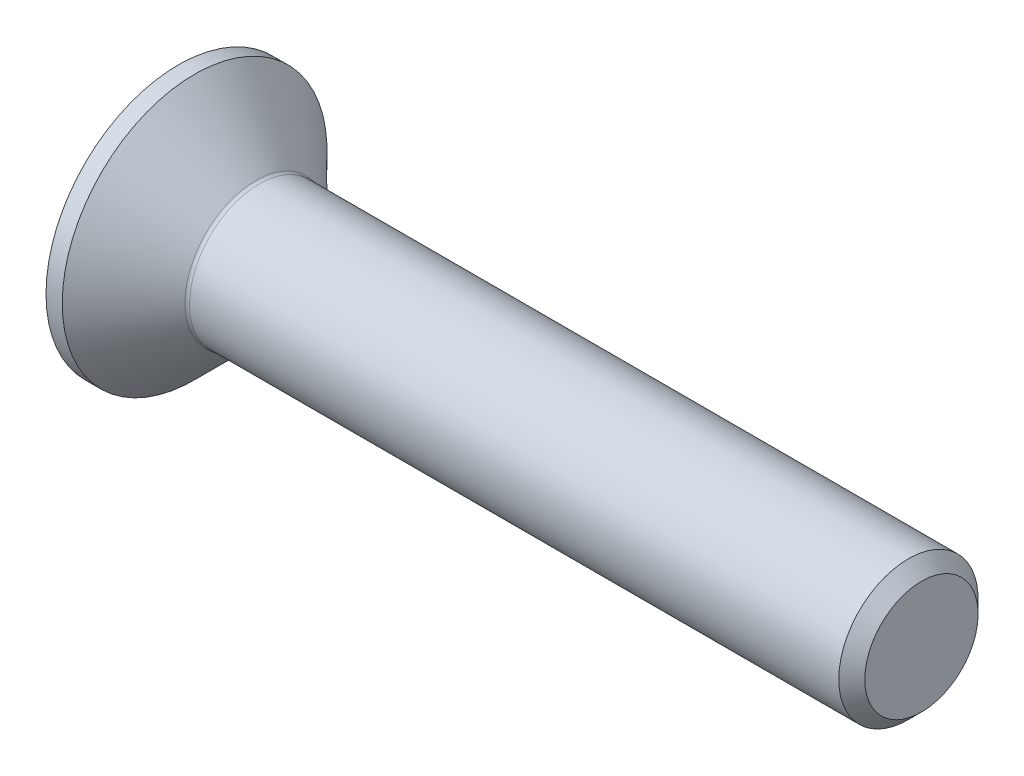
ISO-10303-21;
HEADER;
FILE_DESCRIPTION(('STEP AP214'),'2;1');
FILE_NAME('part.step','',(''),(''),'','','');
FILE_SCHEMA(('AUTOMOTIVE_DESIGN { 1 0 10303 214 1 1 1 1 }'));
ENDSEC;
DATA;
#1=APPLICATION_CONTEXT('core data for automotive mechanical design processes');
#2=APPLICATION_PROTOCOL_DEFINITION('international standard','automotive_design',2000,#1);
#3=PRODUCT_CONTEXT('',#1,'mechanical');
#4=PRODUCT('Part','Part','',(#3));
#5=PRODUCT_RELATED_PRODUCT_CATEGORY('part','',(#4));
#6=PRODUCT_DEFINITION_FORMATION('','',#4);
#7=PRODUCT_DEFINITION_CONTEXT('part definition',#1,'design');
#8=PRODUCT_DEFINITION('design','',#6,#7);
#9=PRODUCT_DEFINITION_SHAPE('','',#8);
#10=(LENGTH_UNIT() NAMED_UNIT(*) SI_UNIT(.MILLI.,.METRE.));
#11=(NAMED_UNIT(*) PLANE_ANGLE_UNIT() SI_UNIT($,.RADIAN.));
#12=(NAMED_UNIT(*) SI_UNIT($,.STERADIAN.) SOLID_ANGLE_UNIT());
#13=UNCERTAINTY_MEASURE_WITH_UNIT(LENGTH_MEASURE(1.E-05),#10,'distance_accuracy_value','');
#14=(GEOMETRIC_REPRESENTATION_CONTEXT(3) GLOBAL_UNCERTAINTY_ASSIGNED_CONTEXT((#13)) GLOBAL_UNIT_ASSIGNED_CONTEXT((#10,
#11,#12)) REPRESENTATION_CONTEXT('',''));
#15=CARTESIAN_POINT('',(0.,0.,0.));
#16=DIRECTION('',(0.,0.,1.));
#17=DIRECTION('',(1.,0.,0.));
#18=AXIS2_PLACEMENT_3D('',#15,#16,#17);
#19=CARTESIAN_POINT('',(0.,0.,0.));
#20=DIRECTION('',(-1.,0.,0.));
#21=DIRECTION('',(0.,0.,1.));
#22=AXIS2_PLACEMENT_3D('',#19,#20,#21);
#23=PLANE('',#22);
#24=CARTESIAN_POINT('',(0.,0.,0.));
#25=DIRECTION('',(-1.,0.,0.));
#26=DIRECTION('',(0.,0.,1.));
#27=AXIS2_PLACEMENT_3D('',#24,#25,#26);
#28=CIRCLE('',#27,2.85);
#29=CARTESIAN_POINT('',(0.,0.,2.85));
#30=VERTEX_POINT('',#29);
#31=EDGE_CURVE('E155',#30,#30,#28,.T.);
#32=ORIENTED_EDGE('',*,*,#31,.T.);
#33=EDGE_LOOP('',(#32));
#34=FACE_BOUND('',#33,.T.);
#35=DIRECTION('',(0.,-0.5,-0.866025403784439));
#36=VECTOR('',#35,1.);
#37=CARTESIAN_POINT('',(0.,-0.583123771881521,1.01));
#38=LINE('',#37,#36);
#39=CARTESIAN_POINT('',(0.,-0.583123771881521,1.01));
#40=VERTEX_POINT('',#39);
#41=CARTESIAN_POINT('',(0.,-1.16624754376304,0.));
#42=VERTEX_POINT('',#41);
#43=EDGE_CURVE('E121',#40,#42,#38,.T.);
#44=ORIENTED_EDGE('',*,*,#43,.T.);
#45=DIRECTION('',(0.,0.5,-0.866025403784439));
#46=VECTOR('',#45,1.);
#47=CARTESIAN_POINT('',(0.,-1.16624754376304,0.));
#48=LINE('',#47,#46);
#49=CARTESIAN_POINT('',(0.,-0.583123771881521,-1.01));
#50=VERTEX_POINT('',#49);
#51=EDGE_CURVE('E52',#42,#50,#48,.T.);
#52=ORIENTED_EDGE('',*,*,#51,.T.);
#53=DIRECTION('',(0.,1.,0.));
#54=VECTOR('',#53,1.);
#55=CARTESIAN_POINT('',(0.,-0.583123771881521,-1.01));
#56=LINE('',#55,#54);
#57=CARTESIAN_POINT('',(0.,0.583123771881523,-1.01));
#58=VERTEX_POINT('',#57);
#59=EDGE_CURVE('E132',#50,#58,#56,.T.);
#60=ORIENTED_EDGE('',*,*,#59,.T.);
#61=DIRECTION('',(0.,0.5,0.866025403784439));
#62=VECTOR('',#61,1.);
#63=CARTESIAN_POINT('',(0.,0.583123771881523,-1.01));
#64=LINE('',#63,#62);
#65=CARTESIAN_POINT('',(0.,1.16624754376305,0.));
#66=VERTEX_POINT('',#65);
#67=EDGE_CURVE('E256',#58,#66,#64,.T.);
#68=ORIENTED_EDGE('',*,*,#67,.T.);
#69=DIRECTION('',(0.,-0.5,0.866025403784439));
#70=VECTOR('',#69,1.);
#71=CARTESIAN_POINT('',(0.,1.16624754376305,0.));
#72=LINE('',#71,#70);
#73=CARTESIAN_POINT('',(0.,0.583123771881523,1.01));
#74=VERTEX_POINT('',#73);
#75=EDGE_CURVE('E259',#66,#74,#72,.T.);
#76=ORIENTED_EDGE('',*,*,#75,.T.);
#77=DIRECTION('',(0.,-1.,0.));
#78=VECTOR('',#77,1.);
#79=CARTESIAN_POINT('',(0.,0.583123771881523,1.01));
#80=LINE('',#79,#78);
#81=EDGE_CURVE('E262',#74,#40,#80,.T.);
#82=ORIENTED_EDGE('',*,*,#81,.T.);
#83=EDGE_LOOP('',(#44,#52,#60,#68,#76,#82));
#84=FACE_BOUND('',#83,.T.);
#85=ADVANCED_FACE('F37',(#34,#84),#23,.T.);
#86=CARTESIAN_POINT('',(0.,0.,0.));
#87=DIRECTION('',(-1.,0.,0.));
#88=DIRECTION('',(0.,0.,1.));
#89=AXIS2_PLACEMENT_3D('',#86,#87,#88);
#90=CYLINDRICAL_SURFACE('',#89,2.85);
#91=CARTESIAN_POINT('',(0.350000000000005,0.,0.));
#92=DIRECTION('',(-1.,0.,0.));
#93=DIRECTION('',(0.,0.,1.));
#94=AXIS2_PLACEMENT_3D('',#91,#92,#93);
#95=CIRCLE('',#94,2.85);
#96=CARTESIAN_POINT('',(0.350000000000005,0.,2.85));
#97=VERTEX_POINT('',#96);
#98=EDGE_CURVE('E152',#97,#97,#95,.T.);
#99=ORIENTED_EDGE('',*,*,#98,.T.);
#100=EDGE_LOOP('',(#99));
#101=FACE_BOUND('',#100,.T.);
#102=ORIENTED_EDGE('',*,*,#31,.F.);
#103=EDGE_LOOP('',(#102));
#104=FACE_BOUND('',#103,.T.);
#105=ADVANCED_FACE('F176',(#101,#104),#90,.T.);
#106=CARTESIAN_POINT('',(0.350000000000005,0.,0.));
#107=DIRECTION('',(-1.,0.,0.));
#108=DIRECTION('',(0.,0.,1.));
#109=AXIS2_PLACEMENT_3D('',#106,#107,#108);
#110=CONICAL_SURFACE('',#109,2.85,0.78539816339745);
#111=CARTESIAN_POINT('',(1.67071067811867,0.,0.));
#112=DIRECTION('',(-1.,0.,0.));
#113=DIRECTION('',(0.,0.,1.));
#114=AXIS2_PLACEMENT_3D('',#111,#112,#113);
#115=CIRCLE('',#114,1.52928932188133);
#116=CARTESIAN_POINT('',(1.67071067811867,0.,1.52928932188133));
#117=VERTEX_POINT('',#116);
#118=EDGE_CURVE('E45',#117,#117,#115,.T.);
#119=ORIENTED_EDGE('',*,*,#118,.T.);
#120=EDGE_LOOP('',(#119));
#121=FACE_BOUND('',#120,.T.);
#122=ORIENTED_EDGE('',*,*,#98,.F.);
#123=EDGE_LOOP('',(#122));
#124=FACE_BOUND('',#123,.T.);
#125=ADVANCED_FACE('F160',(#121,#124),#110,.T.);
#126=CARTESIAN_POINT('',(0.,0.,0.));
#127=DIRECTION('',(-1.,0.,0.));
#128=DIRECTION('',(0.,0.,1.));
#129=AXIS2_PLACEMENT_3D('',#126,#127,#128);
#130=CYLINDRICAL_SURFACE('',#129,1.49999999999999);
#131=CARTESIAN_POINT('',(1.74142135623732,0.,0.));
#132=DIRECTION('',(-1.,0.,0.));
#133=DIRECTION('',(0.,0.,1.));
#134=AXIS2_PLACEMENT_3D('',#131,#132,#133);
#135=CIRCLE('',#134,1.49999999999999);
#136=CARTESIAN_POINT('',(1.74142135623732,0.,1.49999999999999));
#137=VERTEX_POINT('',#136);
#138=EDGE_CURVE('E11',#137,#137,#135,.F.);
#139=ORIENTED_EDGE('',*,*,#138,.T.);
#140=EDGE_LOOP('',(#139));
#141=FACE_BOUND('',#140,.T.);
#142=CARTESIAN_POINT('',(15.7195,0.,0.));
#143=DIRECTION('',(-1.,0.,0.));
#144=DIRECTION('',(0.,0.,1.));
#145=AXIS2_PLACEMENT_3D('',#142,#143,#144);
#146=CIRCLE('',#145,1.49999999999998);
#147=CARTESIAN_POINT('',(15.7195,0.,1.49999999999998));
#148=VERTEX_POINT('',#147);
#149=EDGE_CURVE('E149',#148,#148,#146,.T.);
#150=ORIENTED_EDGE('',*,*,#149,.T.);
#151=EDGE_LOOP('',(#150));
#152=FACE_BOUND('',#151,.T.);
#153=ADVANCED_FACE('F187',(#141,#152),#130,.T.);
#154=CARTESIAN_POINT('',(16.,0.,0.));
#155=DIRECTION('',(-1.,0.,0.));
#156=DIRECTION('',(0.,0.,1.));
#157=AXIS2_PLACEMENT_3D('',#154,#155,#156);
#158=CONICAL_SURFACE('',#157,1.2195,0.785398163397391);
#159=ORIENTED_EDGE('',*,*,#149,.F.);
#160=EDGE_LOOP('',(#159));
#161=FACE_BOUND('',#160,.T.);
#162=CARTESIAN_POINT('',(16.,0.,0.));
#163=DIRECTION('',(-1.,0.,0.));
#164=DIRECTION('',(0.,0.,1.));
#165=AXIS2_PLACEMENT_3D('',#162,#163,#164);
#166=CIRCLE('',#165,1.2195);
#167=CARTESIAN_POINT('',(16.,0.,1.2195));
#168=VERTEX_POINT('',#167);
#169=EDGE_CURVE('E145',#168,#168,#166,.T.);
#170=ORIENTED_EDGE('',*,*,#169,.T.);
#171=EDGE_LOOP('',(#170));
#172=FACE_BOUND('',#171,.T.);
#173=ADVANCED_FACE('F171',(#161,#172),#158,.T.);
#174=CARTESIAN_POINT('',(16.,1.2195,0.));
#175=DIRECTION('',(1.,0.,0.));
#176=DIRECTION('',(0.,0.,-1.));
#177=AXIS2_PLACEMENT_3D('',#174,#175,#176);
#178=PLANE('',#177);
#179=ORIENTED_EDGE('',*,*,#169,.F.);
#180=EDGE_LOOP('',(#179));
#181=FACE_BOUND('',#180,.T.);
#182=ADVANCED_FACE('F164',(#181),#178,.T.);
#183=CARTESIAN_POINT('',(1.74142135623732,0.,0.));
#184=DIRECTION('',(-1.,0.,0.));
#185=DIRECTION('',(0.,0.,1.));
#186=AXIS2_PLACEMENT_3D('',#183,#184,#185);
#187=TOROIDAL_SURFACE('',#186,1.59999999999999,0.1);
#188=ORIENTED_EDGE('',*,*,#138,.F.);
#189=EDGE_LOOP('',(#188));
#190=FACE_BOUND('',#189,.T.);
#191=ORIENTED_EDGE('',*,*,#118,.F.);
#192=EDGE_LOOP('',(#191));
#193=FACE_BOUND('',#192,.T.);
#194=ADVANCED_FACE('F39',(#190,#193),#187,.F.);
#195=CARTESIAN_POINT('',(1.2,-1.16624754376304,0.));
#196=DIRECTION('',(0.,0.866025403784439,0.5));
#197=DIRECTION('',(0.,-0.5,0.866025403784439));
#198=AXIS2_PLACEMENT_3D('',#195,#196,#197);
#199=PLANE('',#198);
#200=ORIENTED_EDGE('',*,*,#51,.F.);
#201=DIRECTION('',(-1.,0.,0.));
#202=VECTOR('',#201,1.);
#203=CARTESIAN_POINT('',(1.2,-1.16624754376304,0.));
#204=LINE('',#203,#202);
#205=CARTESIAN_POINT('',(1.2,-1.16624754376304,0.));
#206=VERTEX_POINT('',#205);
#207=EDGE_CURVE('E253',#206,#42,#204,.T.);
#208=ORIENTED_EDGE('',*,*,#207,.F.);
#209=DIRECTION('',(0.,0.5,-0.866025403784439));
#210=VECTOR('',#209,1.);
#211=CARTESIAN_POINT('',(1.2,-1.16624754376304,0.));
#212=LINE('',#211,#210);
#213=CARTESIAN_POINT('',(1.2,-0.874685657822282,-0.504999999999999));
#214=VERTEX_POINT('',#213);
#215=EDGE_CURVE('E117',#206,#214,#212,.T.);
#216=ORIENTED_EDGE('',*,*,#215,.T.);
#217=CARTESIAN_POINT('',(1.2,-0.583123771881521,-1.01));
#218=VERTEX_POINT('',#217);
#219=EDGE_CURVE('E113',#214,#218,#212,.T.);
#220=ORIENTED_EDGE('',*,*,#219,.T.);
#221=DIRECTION('',(-1.,0.,0.));
#222=VECTOR('',#221,1.);
#223=CARTESIAN_POINT('',(1.2,-0.583123771881521,-1.01));
#224=LINE('',#223,#222);
#225=EDGE_CURVE('E115',#218,#50,#224,.T.);
#226=ORIENTED_EDGE('',*,*,#225,.T.);
#227=EDGE_LOOP('',(#200,#208,#216,#220,#226));
#228=FACE_BOUND('',#227,.T.);
#229=ADVANCED_FACE('F114',(#228),#199,.T.);
#230=CARTESIAN_POINT('',(1.2,-0.583123771881521,-1.01));
#231=DIRECTION('',(0.,0.,1.));
#232=DIRECTION('',(1.,0.,0.));
#233=AXIS2_PLACEMENT_3D('',#230,#231,#232);
#234=PLANE('',#233);
#235=ORIENTED_EDGE('',*,*,#59,.F.);
#236=ORIENTED_EDGE('',*,*,#225,.F.);
#237=DIRECTION('',(0.,1.,0.));
#238=VECTOR('',#237,1.);
#239=CARTESIAN_POINT('',(1.2,-0.583123771881521,-1.01));
#240=LINE('',#239,#238);
#241=CARTESIAN_POINT('',(1.2,0.,-1.01));
#242=VERTEX_POINT('',#241);
#243=EDGE_CURVE('E60',#218,#242,#240,.T.);
#244=ORIENTED_EDGE('',*,*,#243,.T.);
#245=CARTESIAN_POINT('',(1.2,0.583123771881523,-1.01));
#246=VERTEX_POINT('',#245);
#247=EDGE_CURVE('E127',#242,#246,#240,.T.);
#248=ORIENTED_EDGE('',*,*,#247,.T.);
#249=DIRECTION('',(-1.,0.,0.));
#250=VECTOR('',#249,1.);
#251=CARTESIAN_POINT('',(1.2,0.583123771881523,-1.01));
#252=LINE('',#251,#250);
#253=EDGE_CURVE('E134',#246,#58,#252,.T.);
#254=ORIENTED_EDGE('',*,*,#253,.T.);
#255=EDGE_LOOP('',(#235,#236,#244,#248,#254));
#256=FACE_BOUND('',#255,.T.);
#257=ADVANCED_FACE('F129',(#256),#234,.T.);
#258=CARTESIAN_POINT('',(1.2,0.583123771881523,-1.01));
#259=DIRECTION('',(0.,-0.866025403784439,0.5));
#260=DIRECTION('',(0.,-0.5,-0.866025403784439));
#261=AXIS2_PLACEMENT_3D('',#258,#259,#260);
#262=PLANE('',#261);
#263=ORIENTED_EDGE('',*,*,#67,.F.);
#264=ORIENTED_EDGE('',*,*,#253,.F.);
#265=DIRECTION('',(0.,0.5,0.866025403784439));
#266=VECTOR('',#265,1.);
#267=CARTESIAN_POINT('',(1.2,0.583123771881523,-1.01));
#268=LINE('',#267,#266);
#269=CARTESIAN_POINT('',(1.2,0.874685657822284,-0.505000000000001));
#270=VERTEX_POINT('',#269);
#271=EDGE_CURVE('E234',#246,#270,#268,.T.);
#272=ORIENTED_EDGE('',*,*,#271,.T.);
#273=CARTESIAN_POINT('',(1.2,1.16624754376305,0.));
#274=VERTEX_POINT('',#273);
#275=EDGE_CURVE('E126',#270,#274,#268,.T.);
#276=ORIENTED_EDGE('',*,*,#275,.T.);
#277=DIRECTION('',(-1.,0.,0.));
#278=VECTOR('',#277,1.);
#279=CARTESIAN_POINT('',(1.2,1.16624754376305,0.));
#280=LINE('',#279,#278);
#281=EDGE_CURVE('E140',#274,#66,#280,.T.);
#282=ORIENTED_EDGE('',*,*,#281,.T.);
#283=EDGE_LOOP('',(#263,#264,#272,#276,#282));
#284=FACE_BOUND('',#283,.T.);
#285=ADVANCED_FACE('F201',(#284),#262,.T.);
#286=CARTESIAN_POINT('',(1.2,1.16624754376305,0.));
#287=DIRECTION('',(0.,-0.866025403784439,-0.5));
#288=DIRECTION('',(0.,0.5,-0.866025403784439));
#289=AXIS2_PLACEMENT_3D('',#286,#287,#288);
#290=PLANE('',#289);
#291=ORIENTED_EDGE('',*,*,#75,.F.);
#292=ORIENTED_EDGE('',*,*,#281,.F.);
#293=DIRECTION('',(0.,-0.5,0.866025403784439));
#294=VECTOR('',#293,1.);
#295=CARTESIAN_POINT('',(1.2,1.16624754376305,0.));
#296=LINE('',#295,#294);
#297=CARTESIAN_POINT('',(1.2,0.874685657822284,0.505));
#298=VERTEX_POINT('',#297);
#299=EDGE_CURVE('E241',#274,#298,#296,.T.);
#300=ORIENTED_EDGE('',*,*,#299,.T.);
#301=CARTESIAN_POINT('',(1.2,0.583123771881523,1.01));
#302=VERTEX_POINT('',#301);
#303=EDGE_CURVE('E239',#298,#302,#296,.T.);
#304=ORIENTED_EDGE('',*,*,#303,.T.);
#305=DIRECTION('',(-1.,0.,0.));
#306=VECTOR('',#305,1.);
#307=CARTESIAN_POINT('',(1.2,0.583123771881523,1.01));
#308=LINE('',#307,#306);
#309=EDGE_CURVE('E271',#302,#74,#308,.T.);
#310=ORIENTED_EDGE('',*,*,#309,.T.);
#311=EDGE_LOOP('',(#291,#292,#300,#304,#310));
#312=FACE_BOUND('',#311,.T.);
#313=ADVANCED_FACE('F204',(#312),#290,.T.);
#314=CARTESIAN_POINT('',(1.2,0.583123771881523,1.01));
#315=DIRECTION('',(0.,0.,-1.));
#316=DIRECTION('',(-1.,0.,0.));
#317=AXIS2_PLACEMENT_3D('',#314,#315,#316);
#318=PLANE('',#317);
#319=ORIENTED_EDGE('',*,*,#81,.F.);
#320=ORIENTED_EDGE('',*,*,#309,.F.);
#321=DIRECTION('',(0.,-1.,0.));
#322=VECTOR('',#321,1.);
#323=CARTESIAN_POINT('',(1.2,0.583123771881523,1.01));
#324=LINE('',#323,#322);
#325=CARTESIAN_POINT('',(1.2,0.,1.01));
#326=VERTEX_POINT('',#325);
#327=EDGE_CURVE('E246',#302,#326,#324,.T.);
#328=ORIENTED_EDGE('',*,*,#327,.T.);
#329=CARTESIAN_POINT('',(1.2,-0.583123771881521,1.01));
#330=VERTEX_POINT('',#329);
#331=EDGE_CURVE('E245',#326,#330,#324,.T.);
#332=ORIENTED_EDGE('',*,*,#331,.T.);
#333=DIRECTION('',(-1.,0.,0.));
#334=VECTOR('',#333,1.);
#335=CARTESIAN_POINT('',(1.2,-0.583123771881521,1.01));
#336=LINE('',#335,#334);
#337=EDGE_CURVE('E268',#330,#40,#336,.T.);
#338=ORIENTED_EDGE('',*,*,#337,.T.);
#339=EDGE_LOOP('',(#319,#320,#328,#332,#338));
#340=FACE_BOUND('',#339,.T.);
#341=ADVANCED_FACE('F208',(#340),#318,.T.);
#342=CARTESIAN_POINT('',(1.2,-0.583123771881521,1.01));
#343=DIRECTION('',(0.,0.866025403784439,-0.5));
#344=DIRECTION('',(0.,0.5,0.866025403784439));
#345=AXIS2_PLACEMENT_3D('',#342,#343,#344);
#346=PLANE('',#345);
#347=ORIENTED_EDGE('',*,*,#43,.F.);
#348=ORIENTED_EDGE('',*,*,#337,.F.);
#349=DIRECTION('',(0.,-0.5,-0.866025403784439));
#350=VECTOR('',#349,1.);
#351=CARTESIAN_POINT('',(1.2,-0.583123771881521,1.01));
#352=LINE('',#351,#350);
#353=CARTESIAN_POINT('',(1.2,-0.874685657822282,0.504999999999999));
#354=VERTEX_POINT('',#353);
#355=EDGE_CURVE('E250',#330,#354,#352,.T.);
#356=ORIENTED_EDGE('',*,*,#355,.T.);
#357=EDGE_CURVE('E249',#354,#206,#352,.T.);
#358=ORIENTED_EDGE('',*,*,#357,.T.);
#359=ORIENTED_EDGE('',*,*,#207,.T.);
#360=EDGE_LOOP('',(#347,#348,#356,#358,#359));
#361=FACE_BOUND('',#360,.T.);
#362=ADVANCED_FACE('F212',(#361),#346,.T.);
#363=CARTESIAN_POINT('',(1.2,-0.583123771881521,-1.01));
#364=DIRECTION('',(1.,0.,0.));
#365=DIRECTION('',(0.,0.,-1.));
#366=AXIS2_PLACEMENT_3D('',#363,#364,#365);
#367=PLANE('',#366);
#368=ORIENTED_EDGE('',*,*,#243,.F.);
#369=ORIENTED_EDGE('',*,*,#219,.F.);
#370=CARTESIAN_POINT('',(1.2,0.,0.));
#371=DIRECTION('',(-1.,0.,0.));
#372=DIRECTION('',(0.,0.,1.));
#373=AXIS2_PLACEMENT_3D('',#370,#371,#372);
#374=CIRCLE('',#373,1.01);
#375=EDGE_CURVE('E124',#242,#214,#374,.T.);
#376=ORIENTED_EDGE('',*,*,#375,.F.);
#377=EDGE_LOOP('',(#368,#369,#376));
#378=FACE_BOUND('',#377,.T.);
#379=ADVANCED_FACE('F123',(#378),#367,.F.);
#380=ORIENTED_EDGE('',*,*,#215,.F.);
#381=ORIENTED_EDGE('',*,*,#357,.F.);
#382=EDGE_CURVE('E137',#214,#354,#374,.T.);
#383=ORIENTED_EDGE('',*,*,#382,.F.);
#384=EDGE_LOOP('',(#380,#381,#383));
#385=FACE_BOUND('',#384,.T.);
#386=ADVANCED_FACE('F218',(#385),#367,.F.);
#387=ORIENTED_EDGE('',*,*,#355,.F.);
#388=ORIENTED_EDGE('',*,*,#331,.F.);
#389=EDGE_CURVE('E133',#354,#326,#374,.T.);
#390=ORIENTED_EDGE('',*,*,#389,.F.);
#391=EDGE_LOOP('',(#387,#388,#390));
#392=FACE_BOUND('',#391,.T.);
#393=ADVANCED_FACE('F222',(#392),#367,.F.);
#394=ORIENTED_EDGE('',*,*,#327,.F.);
#395=ORIENTED_EDGE('',*,*,#303,.F.);
#396=EDGE_CURVE('E139',#326,#298,#374,.T.);
#397=ORIENTED_EDGE('',*,*,#396,.F.);
#398=EDGE_LOOP('',(#394,#395,#397));
#399=FACE_BOUND('',#398,.T.);
#400=ADVANCED_FACE('F230',(#399),#367,.F.);
#401=ORIENTED_EDGE('',*,*,#299,.F.);
#402=ORIENTED_EDGE('',*,*,#275,.F.);
#403=EDGE_CURVE('E146',#298,#270,#374,.T.);
#404=ORIENTED_EDGE('',*,*,#403,.F.);
#405=EDGE_LOOP('',(#401,#402,#404));
#406=FACE_BOUND('',#405,.T.);
#407=ADVANCED_FACE('F225',(#406),#367,.F.);
#408=ORIENTED_EDGE('',*,*,#271,.F.);
#409=ORIENTED_EDGE('',*,*,#247,.F.);
#410=EDGE_CURVE('E235',#270,#242,#374,.T.);
#411=ORIENTED_EDGE('',*,*,#410,.F.);
#412=EDGE_LOOP('',(#408,#409,#411));
#413=FACE_BOUND('',#412,.T.);
#414=ADVANCED_FACE('F196',(#413),#367,.F.);
#415=CARTESIAN_POINT('',(1.2,0.,0.));
#416=DIRECTION('',(-1.,0.,0.));
#417=DIRECTION('',(0.,0.,1.));
#418=AXIS2_PLACEMENT_3D('',#415,#416,#417);
#419=CONICAL_SURFACE('',#418,1.01,1.04719755119659);
#420=CARTESIAN_POINT('',(1.78312377188153,0.,0.));
#421=VERTEX_POINT('',#420);
#422=VERTEX_LOOP('',#421);
#423=FACE_BOUND('',#422,.T.);
#424=ORIENTED_EDGE('',*,*,#396,.T.);
#425=ORIENTED_EDGE('',*,*,#403,.T.);
#426=ORIENTED_EDGE('',*,*,#410,.T.);
#427=ORIENTED_EDGE('',*,*,#375,.T.);
#428=ORIENTED_EDGE('',*,*,#382,.T.);
#429=ORIENTED_EDGE('',*,*,#389,.T.);
#430=EDGE_LOOP('',(#424,#425,#426,#427,#428,#429));
#431=FACE_BOUND('',#430,.T.);
#432=ADVANCED_FACE('F194',(#423,#431),#419,.F.);
#433=CLOSED_SHELL('',(#85,#105,#125,#153,#173,#182,#194,#229,#257,#285,#313,#341,#362,#379,#386,
#393,#400,#407,#414,#432));
#434=MANIFOLD_SOLID_BREP('B2',#433);
#435=ADVANCED_BREP_SHAPE_REPRESENTATION('',(#18,#434),#14);
#436=SHAPE_DEFINITION_REPRESENTATION(#9,#435);
ENDSEC;
END-ISO-10303-21;
